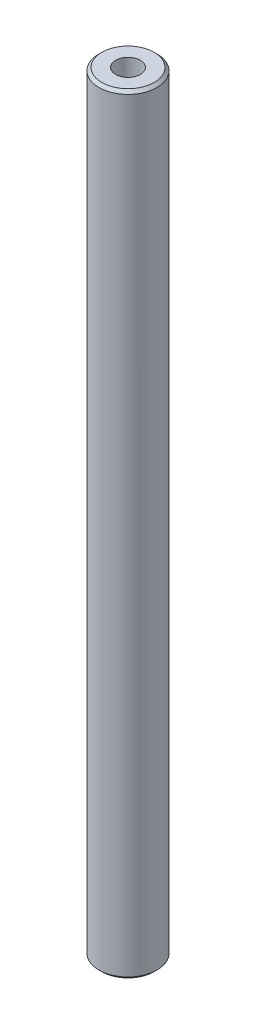
ISO-10303-21;
HEADER;
FILE_DESCRIPTION(('STEP AP214'),'2;1');
FILE_NAME('part.step','',(''),(''),'','','');
FILE_SCHEMA(('AUTOMOTIVE_DESIGN { 1 0 10303 214 1 1 1 1 }'));
ENDSEC;
DATA;
#1=APPLICATION_CONTEXT('core data for automotive mechanical design processes');
#2=APPLICATION_PROTOCOL_DEFINITION('international standard','automotive_design',2000,#1);
#3=PRODUCT_CONTEXT('',#1,'mechanical');
#4=PRODUCT('Part','Part','',(#3));
#5=PRODUCT_RELATED_PRODUCT_CATEGORY('part','',(#4));
#6=PRODUCT_DEFINITION_FORMATION('','',#4);
#7=PRODUCT_DEFINITION_CONTEXT('part definition',#1,'design');
#8=PRODUCT_DEFINITION('design','',#6,#7);
#9=PRODUCT_DEFINITION_SHAPE('','',#8);
#10=(LENGTH_UNIT() NAMED_UNIT(*) SI_UNIT(.MILLI.,.METRE.));
#11=(NAMED_UNIT(*) PLANE_ANGLE_UNIT() SI_UNIT($,.RADIAN.));
#12=(NAMED_UNIT(*) SI_UNIT($,.STERADIAN.) SOLID_ANGLE_UNIT());
#13=UNCERTAINTY_MEASURE_WITH_UNIT(LENGTH_MEASURE(1.E-05),#10,'distance_accuracy_value','');
#14=(GEOMETRIC_REPRESENTATION_CONTEXT(3) GLOBAL_UNCERTAINTY_ASSIGNED_CONTEXT((#13)) GLOBAL_UNIT_ASSIGNED_CONTEXT((#10,
#11,#12)) REPRESENTATION_CONTEXT('',''));
#15=CARTESIAN_POINT('',(0.,0.,0.));
#16=DIRECTION('',(0.,0.,1.));
#17=DIRECTION('',(1.,0.,0.));
#18=AXIS2_PLACEMENT_3D('',#15,#16,#17);
#19=CARTESIAN_POINT('',(0.,132.5,0.));
#20=DIRECTION('',(0.,1.,0.));
#21=DIRECTION('',(0.,0.,1.));
#22=AXIS2_PLACEMENT_3D('',#19,#20,#21);
#23=PLANE('',#22);
#24=CARTESIAN_POINT('',(0.,132.5,0.));
#25=DIRECTION('',(0.,1.,0.));
#26=DIRECTION('',(0.,0.,1.));
#27=AXIS2_PLACEMENT_3D('',#24,#25,#26);
#28=CIRCLE('',#27,9.00000000000001);
#29=CARTESIAN_POINT('',(0.,132.5,9.00000000000001));
#30=VERTEX_POINT('',#29);
#31=EDGE_CURVE('E79',#30,#30,#28,.T.);
#32=ORIENTED_EDGE('',*,*,#31,.T.);
#33=EDGE_LOOP('',(#32));
#34=FACE_BOUND('',#33,.T.);
#35=CARTESIAN_POINT('',(0.,132.5,0.));
#36=DIRECTION('',(0.,1.,0.));
#37=DIRECTION('',(0.,0.,1.));
#38=AXIS2_PLACEMENT_3D('',#35,#36,#37);
#39=CIRCLE('',#38,4.25);
#40=CARTESIAN_POINT('',(0.,132.5,4.25));
#41=VERTEX_POINT('',#40);
#42=EDGE_CURVE('E69',#41,#41,#39,.T.);
#43=ORIENTED_EDGE('',*,*,#42,.F.);
#44=EDGE_LOOP('',(#43));
#45=FACE_BOUND('',#44,.T.);
#46=ADVANCED_FACE('F43',(#34,#45),#23,.T.);
#47=CARTESIAN_POINT('',(0.,132.5,0.));
#48=DIRECTION('',(0.,1.,0.));
#49=DIRECTION('',(0.,0.,1.));
#50=AXIS2_PLACEMENT_3D('',#47,#48,#49);
#51=CYLINDRICAL_SURFACE('',#50,10.);
#52=CARTESIAN_POINT('',(0.,131.5,0.));
#53=DIRECTION('',(0.,1.,0.));
#54=DIRECTION('',(0.,0.,1.));
#55=AXIS2_PLACEMENT_3D('',#52,#53,#54);
#56=CIRCLE('',#55,10.);
#57=CARTESIAN_POINT('',(0.,131.5,10.));
#58=VERTEX_POINT('',#57);
#59=EDGE_CURVE('E52',#58,#58,#56,.F.);
#60=ORIENTED_EDGE('',*,*,#59,.T.);
#61=EDGE_LOOP('',(#60));
#62=FACE_BOUND('',#61,.T.);
#63=CARTESIAN_POINT('',(0.,-131.5,0.));
#64=DIRECTION('',(0.,-1.,0.));
#65=DIRECTION('',(0.,0.,-1.));
#66=AXIS2_PLACEMENT_3D('',#63,#64,#65);
#67=CIRCLE('',#66,10.);
#68=CARTESIAN_POINT('',(0.,-131.5,-10.));
#69=VERTEX_POINT('',#68);
#70=EDGE_CURVE('E82',#69,#69,#67,.F.);
#71=ORIENTED_EDGE('',*,*,#70,.T.);
#72=EDGE_LOOP('',(#71));
#73=FACE_BOUND('',#72,.T.);
#74=ADVANCED_FACE('F87',(#62,#73),#51,.T.);
#75=CARTESIAN_POINT('',(-9.99999999999997,-132.5,0.));
#76=DIRECTION('',(0.,-1.,0.));
#77=DIRECTION('',(0.,0.,-1.));
#78=AXIS2_PLACEMENT_3D('',#75,#76,#77);
#79=PLANE('',#78);
#80=CARTESIAN_POINT('',(0.,-132.5,0.));
#81=DIRECTION('',(0.,-1.,0.));
#82=DIRECTION('',(0.,0.,-1.));
#83=AXIS2_PLACEMENT_3D('',#80,#81,#82);
#84=CIRCLE('',#83,9.00000000000004);
#85=CARTESIAN_POINT('',(0.,-132.5,-9.00000000000004));
#86=VERTEX_POINT('',#85);
#87=EDGE_CURVE('E11',#86,#86,#84,.T.);
#88=ORIENTED_EDGE('',*,*,#87,.T.);
#89=EDGE_LOOP('',(#88));
#90=FACE_BOUND('',#89,.T.);
#91=CARTESIAN_POINT('',(0.,-132.5,0.));
#92=DIRECTION('',(0.,-1.,0.));
#93=DIRECTION('',(0.,0.,-1.));
#94=AXIS2_PLACEMENT_3D('',#91,#92,#93);
#95=CIRCLE('',#94,4.25);
#96=CARTESIAN_POINT('',(0.,-132.5,-4.25));
#97=VERTEX_POINT('',#96);
#98=EDGE_CURVE('E68',#97,#97,#95,.T.);
#99=ORIENTED_EDGE('',*,*,#98,.F.);
#100=EDGE_LOOP('',(#99));
#101=FACE_BOUND('',#100,.T.);
#102=ADVANCED_FACE('F111',(#90,#101),#79,.T.);
#103=CARTESIAN_POINT('',(0.,-108.,0.));
#104=DIRECTION('',(0.,-1.,0.));
#105=DIRECTION('',(0.,0.,-1.));
#106=AXIS2_PLACEMENT_3D('',#103,#104,#105);
#107=CONICAL_SURFACE('',#106,4.24999999999999,1.02974425867665);
#108=CARTESIAN_POINT('',(0.,-105.446342369133,0.));
#109=VERTEX_POINT('',#108);
#110=VERTEX_LOOP('',#109);
#111=FACE_BOUND('',#110,.T.);
#112=CARTESIAN_POINT('',(0.,-108.,0.));
#113=DIRECTION('',(0.,-1.,0.));
#114=DIRECTION('',(0.,0.,-1.));
#115=AXIS2_PLACEMENT_3D('',#112,#113,#114);
#116=CIRCLE('',#115,4.24999999999999);
#117=CARTESIAN_POINT('',(0.,-108.,-4.24999999999999));
#118=VERTEX_POINT('',#117);
#119=EDGE_CURVE('E72',#118,#118,#116,.T.);
#120=ORIENTED_EDGE('',*,*,#119,.T.);
#121=EDGE_LOOP('',(#120));
#122=FACE_BOUND('',#121,.T.);
#123=ADVANCED_FACE('F107',(#111,#122),#107,.F.);
#124=CARTESIAN_POINT('',(0.,-132.5,0.));
#125=DIRECTION('',(0.,-1.,0.));
#126=DIRECTION('',(0.,0.,-1.));
#127=AXIS2_PLACEMENT_3D('',#124,#125,#126);
#128=CYLINDRICAL_SURFACE('',#127,4.25);
#129=ORIENTED_EDGE('',*,*,#119,.F.);
#130=EDGE_LOOP('',(#129));
#131=FACE_BOUND('',#130,.T.);
#132=ORIENTED_EDGE('',*,*,#98,.T.);
#133=EDGE_LOOP('',(#132));
#134=FACE_BOUND('',#133,.T.);
#135=ADVANCED_FACE('F62',(#131,#134),#128,.F.);
#136=CARTESIAN_POINT('',(0.,108.,0.));
#137=DIRECTION('',(0.,1.,0.));
#138=DIRECTION('',(0.,0.,1.));
#139=AXIS2_PLACEMENT_3D('',#136,#137,#138);
#140=CONICAL_SURFACE('',#139,4.24999999999999,1.02974425867665);
#141=CARTESIAN_POINT('',(0.,105.446342369133,0.));
#142=VERTEX_POINT('',#141);
#143=VERTEX_LOOP('',#142);
#144=FACE_BOUND('',#143,.T.);
#145=CARTESIAN_POINT('',(0.,108.,0.));
#146=DIRECTION('',(0.,1.,0.));
#147=DIRECTION('',(0.,0.,1.));
#148=AXIS2_PLACEMENT_3D('',#145,#146,#147);
#149=CIRCLE('',#148,4.24999999999999);
#150=CARTESIAN_POINT('',(0.,108.,4.24999999999999));
#151=VERTEX_POINT('',#150);
#152=EDGE_CURVE('E66',#151,#151,#149,.T.);
#153=ORIENTED_EDGE('',*,*,#152,.T.);
#154=EDGE_LOOP('',(#153));
#155=FACE_BOUND('',#154,.T.);
#156=ADVANCED_FACE('F58',(#144,#155),#140,.F.);
#157=CARTESIAN_POINT('',(0.,132.5,0.));
#158=DIRECTION('',(0.,1.,0.));
#159=DIRECTION('',(0.,0.,1.));
#160=AXIS2_PLACEMENT_3D('',#157,#158,#159);
#161=CYLINDRICAL_SURFACE('',#160,4.25);
#162=ORIENTED_EDGE('',*,*,#152,.F.);
#163=EDGE_LOOP('',(#162));
#164=FACE_BOUND('',#163,.T.);
#165=ORIENTED_EDGE('',*,*,#42,.T.);
#166=EDGE_LOOP('',(#165));
#167=FACE_BOUND('',#166,.T.);
#168=ADVANCED_FACE('F61',(#164,#167),#161,.F.);
#169=CARTESIAN_POINT('',(0.,132.5,0.));
#170=DIRECTION('',(0.,-1.,0.));
#171=DIRECTION('',(0.,0.,-1.));
#172=AXIS2_PLACEMENT_3D('',#169,#170,#171);
#173=CONICAL_SURFACE('',#172,9.00000000000001,0.78539816339743);
#174=ORIENTED_EDGE('',*,*,#59,.F.);
#175=EDGE_LOOP('',(#174));
#176=FACE_BOUND('',#175,.T.);
#177=ORIENTED_EDGE('',*,*,#31,.F.);
#178=EDGE_LOOP('',(#177));
#179=FACE_BOUND('',#178,.T.);
#180=ADVANCED_FACE('F90',(#176,#179),#173,.T.);
#181=CARTESIAN_POINT('',(0.,-131.5,0.));
#182=DIRECTION('',(0.,1.,0.));
#183=DIRECTION('',(0.,0.,1.));
#184=AXIS2_PLACEMENT_3D('',#181,#182,#183);
#185=CONICAL_SURFACE('',#184,10.,0.78539816339743);
#186=ORIENTED_EDGE('',*,*,#87,.F.);
#187=EDGE_LOOP('',(#186));
#188=FACE_BOUND('',#187,.T.);
#189=ORIENTED_EDGE('',*,*,#70,.F.);
#190=EDGE_LOOP('',(#189));
#191=FACE_BOUND('',#190,.T.);
#192=ADVANCED_FACE('F46',(#188,#191),#185,.T.);
#193=CLOSED_SHELL('',(#46,#74,#102,#123,#135,#156,#168,#180,#192));
#194=MANIFOLD_SOLID_BREP('B2',#193);
#195=ADVANCED_BREP_SHAPE_REPRESENTATION('',(#18,#194),#14);
#196=SHAPE_DEFINITION_REPRESENTATION(#9,#195);
ENDSEC;
END-ISO-10303-21;
